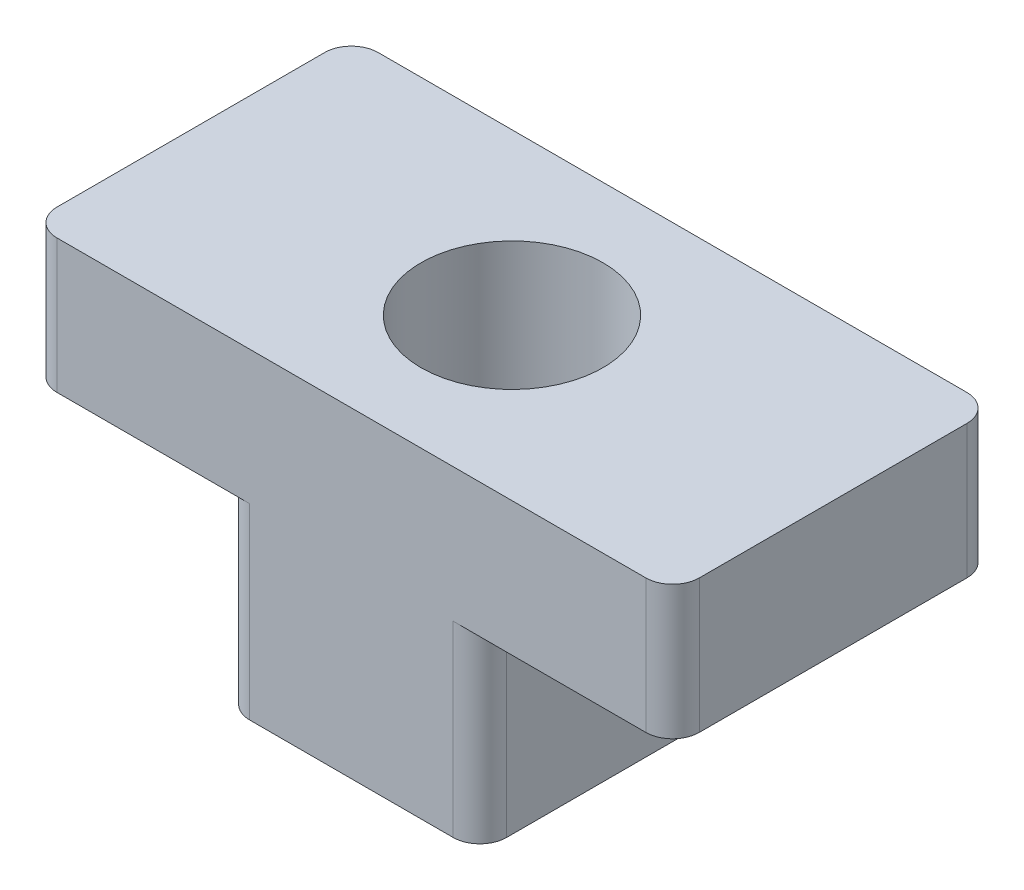
ISO-10303-21;
HEADER;
FILE_DESCRIPTION(('STEP AP214'),'2;1');
FILE_NAME('part.step','',(''),(''),'','','');
FILE_SCHEMA(('AUTOMOTIVE_DESIGN { 1 0 10303 214 1 1 1 1 }'));
ENDSEC;
DATA;
#1=APPLICATION_CONTEXT('core data for automotive mechanical design processes');
#2=APPLICATION_PROTOCOL_DEFINITION('international standard','automotive_design',2000,#1);
#3=PRODUCT_CONTEXT('',#1,'mechanical');
#4=PRODUCT('Part','Part','',(#3));
#5=PRODUCT_RELATED_PRODUCT_CATEGORY('part','',(#4));
#6=PRODUCT_DEFINITION_FORMATION('','',#4);
#7=PRODUCT_DEFINITION_CONTEXT('part definition',#1,'design');
#8=PRODUCT_DEFINITION('design','',#6,#7);
#9=PRODUCT_DEFINITION_SHAPE('','',#8);
#10=(LENGTH_UNIT() NAMED_UNIT(*) SI_UNIT(.MILLI.,.METRE.));
#11=(NAMED_UNIT(*) PLANE_ANGLE_UNIT() SI_UNIT($,.RADIAN.));
#12=(NAMED_UNIT(*) SI_UNIT($,.STERADIAN.) SOLID_ANGLE_UNIT());
#13=UNCERTAINTY_MEASURE_WITH_UNIT(LENGTH_MEASURE(1.E-05),#10,'distance_accuracy_value','');
#14=(GEOMETRIC_REPRESENTATION_CONTEXT(3) GLOBAL_UNCERTAINTY_ASSIGNED_CONTEXT((#13)) GLOBAL_UNIT_ASSIGNED_CONTEXT((#10,
#11,#12)) REPRESENTATION_CONTEXT('',''));
#15=CARTESIAN_POINT('',(0.,0.,0.));
#16=DIRECTION('',(0.,0.,1.));
#17=DIRECTION('',(1.,0.,0.));
#18=AXIS2_PLACEMENT_3D('',#15,#16,#17);
#19=CARTESIAN_POINT('',(6.,0.,3.));
#20=DIRECTION('',(-1.,0.,0.));
#21=DIRECTION('',(0.,0.,1.));
#22=AXIS2_PLACEMENT_3D('',#19,#20,#21);
#23=PLANE('',#22);
#24=DIRECTION('',(0.,0.,-1.));
#25=VECTOR('',#24,1.);
#26=CARTESIAN_POINT('',(6.,0.,3.));
#27=LINE('',#26,#25);
#28=CARTESIAN_POINT('',(6.,0.,2.5));
#29=VERTEX_POINT('',#28);
#30=CARTESIAN_POINT('',(6.,0.,-2.5));
#31=VERTEX_POINT('',#30);
#32=EDGE_CURVE('E187',#29,#31,#27,.T.);
#33=ORIENTED_EDGE('',*,*,#32,.T.);
#34=DIRECTION('',(0.,1.,0.));
#35=VECTOR('',#34,1.);
#36=CARTESIAN_POINT('',(6.,2.5,-2.5));
#37=LINE('',#36,#35);
#38=CARTESIAN_POINT('',(6.,2.5,-2.5));
#39=VERTEX_POINT('',#38);
#40=EDGE_CURVE('E233',#31,#39,#37,.T.);
#41=ORIENTED_EDGE('',*,*,#40,.T.);
#42=DIRECTION('',(0.,0.,-1.));
#43=VECTOR('',#42,1.);
#44=CARTESIAN_POINT('',(6.,2.5,3.));
#45=LINE('',#44,#43);
#46=CARTESIAN_POINT('',(6.,2.5,2.5));
#47=VERTEX_POINT('',#46);
#48=EDGE_CURVE('E193',#47,#39,#45,.T.);
#49=ORIENTED_EDGE('',*,*,#48,.F.);
#50=DIRECTION('',(0.,1.,0.));
#51=VECTOR('',#50,1.);
#52=CARTESIAN_POINT('',(6.,0.,2.5));
#53=LINE('',#52,#51);
#54=EDGE_CURVE('E230',#47,#29,#53,.F.);
#55=ORIENTED_EDGE('',*,*,#54,.T.);
#56=EDGE_LOOP('',(#33,#41,#49,#55));
#57=FACE_BOUND('',#56,.T.);
#58=ADVANCED_FACE('F47',(#57),#23,.F.);
#59=CARTESIAN_POINT('',(-6.,2.5,3.));
#60=DIRECTION('',(0.,-1.,0.));
#61=DIRECTION('',(0.,0.,-1.));
#62=AXIS2_PLACEMENT_3D('',#59,#60,#61);
#63=PLANE('',#62);
#64=CARTESIAN_POINT('',(0.,2.5,0.));
#65=DIRECTION('',(0.,1.,0.));
#66=DIRECTION('',(0.,0.,1.));
#67=AXIS2_PLACEMENT_3D('',#64,#65,#66);
#68=CIRCLE('',#67,1.7);
#69=CARTESIAN_POINT('',(0.,2.5,1.7));
#70=VERTEX_POINT('',#69);
#71=EDGE_CURVE('E381',#70,#70,#68,.T.);
#72=ORIENTED_EDGE('',*,*,#71,.F.);
#73=EDGE_LOOP('',(#72));
#74=FACE_BOUND('',#73,.T.);
#75=ORIENTED_EDGE('',*,*,#48,.T.);
#76=CARTESIAN_POINT('',(5.5,2.5,-2.5));
#77=DIRECTION('',(0.,-1.,0.));
#78=DIRECTION('',(0.,0.,-1.));
#79=AXIS2_PLACEMENT_3D('',#76,#77,#78);
#80=CIRCLE('',#79,0.5);
#81=CARTESIAN_POINT('',(5.5,2.5,-3.));
#82=VERTEX_POINT('',#81);
#83=EDGE_CURVE('E246',#39,#82,#80,.F.);
#84=ORIENTED_EDGE('',*,*,#83,.T.);
#85=DIRECTION('',(-1.,0.,0.));
#86=VECTOR('',#85,1.);
#87=CARTESIAN_POINT('',(-6.,2.5,-3.));
#88=LINE('',#87,#86);
#89=CARTESIAN_POINT('',(-5.5,2.5,-3.));
#90=VERTEX_POINT('',#89);
#91=EDGE_CURVE('E320',#82,#90,#88,.T.);
#92=ORIENTED_EDGE('',*,*,#91,.T.);
#93=CARTESIAN_POINT('',(-5.5,2.5,-2.5));
#94=DIRECTION('',(0.,-1.,0.));
#95=DIRECTION('',(0.,0.,-1.));
#96=AXIS2_PLACEMENT_3D('',#93,#94,#95);
#97=CIRCLE('',#96,0.5);
#98=CARTESIAN_POINT('',(-6.,2.5,-2.5));
#99=VERTEX_POINT('',#98);
#100=EDGE_CURVE('E237',#90,#99,#97,.F.);
#101=ORIENTED_EDGE('',*,*,#100,.T.);
#102=DIRECTION('',(0.,0.,-1.));
#103=VECTOR('',#102,1.);
#104=CARTESIAN_POINT('',(-6.,2.5,3.));
#105=LINE('',#104,#103);
#106=CARTESIAN_POINT('',(-6.,2.5,2.5));
#107=VERTEX_POINT('',#106);
#108=EDGE_CURVE('E203',#107,#99,#105,.T.);
#109=ORIENTED_EDGE('',*,*,#108,.F.);
#110=CARTESIAN_POINT('',(-5.5,2.5,2.5));
#111=DIRECTION('',(0.,-1.,0.));
#112=DIRECTION('',(0.,0.,-1.));
#113=AXIS2_PLACEMENT_3D('',#110,#111,#112);
#114=CIRCLE('',#113,0.5);
#115=CARTESIAN_POINT('',(-5.5,2.5,3.));
#116=VERTEX_POINT('',#115);
#117=EDGE_CURVE('E240',#107,#116,#114,.F.);
#118=ORIENTED_EDGE('',*,*,#117,.T.);
#119=DIRECTION('',(-1.,0.,0.));
#120=VECTOR('',#119,1.);
#121=CARTESIAN_POINT('',(-6.,2.5,3.));
#122=LINE('',#121,#120);
#123=CARTESIAN_POINT('',(5.5,2.5,3.));
#124=VERTEX_POINT('',#123);
#125=EDGE_CURVE('E316',#124,#116,#122,.T.);
#126=ORIENTED_EDGE('',*,*,#125,.F.);
#127=CARTESIAN_POINT('',(5.5,2.5,2.5));
#128=DIRECTION('',(0.,-1.,0.));
#129=DIRECTION('',(0.,0.,-1.));
#130=AXIS2_PLACEMENT_3D('',#127,#128,#129);
#131=CIRCLE('',#130,0.5);
#132=EDGE_CURVE('E243',#124,#47,#131,.F.);
#133=ORIENTED_EDGE('',*,*,#132,.T.);
#134=EDGE_LOOP('',(#75,#84,#92,#101,#109,#118,#126,#133));
#135=FACE_BOUND('',#134,.T.);
#136=ADVANCED_FACE('F356',(#74,#135),#63,.F.);
#137=CARTESIAN_POINT('',(-6.,0.,3.));
#138=DIRECTION('',(1.,0.,0.));
#139=DIRECTION('',(0.,0.,-1.));
#140=AXIS2_PLACEMENT_3D('',#137,#138,#139);
#141=PLANE('',#140);
#142=DIRECTION('',(0.,0.,-1.));
#143=VECTOR('',#142,1.);
#144=CARTESIAN_POINT('',(-6.,0.,3.));
#145=LINE('',#144,#143);
#146=CARTESIAN_POINT('',(-6.,0.,2.5));
#147=VERTEX_POINT('',#146);
#148=CARTESIAN_POINT('',(-6.,0.,-2.5));
#149=VERTEX_POINT('',#148);
#150=EDGE_CURVE('E344',#147,#149,#145,.T.);
#151=ORIENTED_EDGE('',*,*,#150,.F.);
#152=DIRECTION('',(0.,-1.,0.));
#153=VECTOR('',#152,1.);
#154=CARTESIAN_POINT('',(-6.,0.,2.5));
#155=LINE('',#154,#153);
#156=EDGE_CURVE('E283',#147,#107,#155,.F.);
#157=ORIENTED_EDGE('',*,*,#156,.T.);
#158=ORIENTED_EDGE('',*,*,#108,.T.);
#159=DIRECTION('',(0.,-1.,0.));
#160=VECTOR('',#159,1.);
#161=CARTESIAN_POINT('',(-6.,0.,-2.5));
#162=LINE('',#161,#160);
#163=EDGE_CURVE('E281',#99,#149,#162,.T.);
#164=ORIENTED_EDGE('',*,*,#163,.T.);
#165=EDGE_LOOP('',(#151,#157,#158,#164));
#166=FACE_BOUND('',#165,.T.);
#167=ADVANCED_FACE('F350',(#166),#141,.F.);
#168=CARTESIAN_POINT('',(-6.,0.,3.));
#169=DIRECTION('',(0.,1.,0.));
#170=DIRECTION('',(-1.,0.,0.));
#171=AXIS2_PLACEMENT_3D('',#168,#169,#170);
#172=PLANE('',#171);
#173=DIRECTION('',(1.,0.,0.));
#174=VECTOR('',#173,1.);
#175=CARTESIAN_POINT('',(-6.,0.,3.));
#176=LINE('',#175,#174);
#177=CARTESIAN_POINT('',(-5.5,0.,3.));
#178=VERTEX_POINT('',#177);
#179=CARTESIAN_POINT('',(-1.9,0.,3.));
#180=VERTEX_POINT('',#179);
#181=EDGE_CURVE('E295',#178,#180,#176,.T.);
#182=ORIENTED_EDGE('',*,*,#181,.F.);
#183=CARTESIAN_POINT('',(-5.5,0.,2.5));
#184=DIRECTION('',(0.,1.,0.));
#185=DIRECTION('',(-1.,0.,0.));
#186=AXIS2_PLACEMENT_3D('',#183,#184,#185);
#187=CIRCLE('',#186,0.5);
#188=EDGE_CURVE('E71',#178,#147,#187,.F.);
#189=ORIENTED_EDGE('',*,*,#188,.T.);
#190=ORIENTED_EDGE('',*,*,#150,.T.);
#191=CARTESIAN_POINT('',(-5.5,0.,-2.5));
#192=DIRECTION('',(0.,1.,0.));
#193=DIRECTION('',(-1.,0.,0.));
#194=AXIS2_PLACEMENT_3D('',#191,#192,#193);
#195=CIRCLE('',#194,0.5);
#196=CARTESIAN_POINT('',(-5.5,0.,-3.));
#197=VERTEX_POINT('',#196);
#198=EDGE_CURVE('E63',#149,#197,#195,.F.);
#199=ORIENTED_EDGE('',*,*,#198,.T.);
#200=DIRECTION('',(1.,0.,0.));
#201=VECTOR('',#200,1.);
#202=CARTESIAN_POINT('',(-6.,0.,-3.));
#203=LINE('',#202,#201);
#204=CARTESIAN_POINT('',(-1.9,0.,-3.));
#205=VERTEX_POINT('',#204);
#206=EDGE_CURVE('E324',#197,#205,#203,.T.);
#207=ORIENTED_EDGE('',*,*,#206,.T.);
#208=CARTESIAN_POINT('',(-1.9,0.,-2.5));
#209=DIRECTION('',(0.,1.,0.));
#210=DIRECTION('',(-1.,0.,0.));
#211=AXIS2_PLACEMENT_3D('',#208,#209,#210);
#212=CIRCLE('',#211,0.5);
#213=CARTESIAN_POINT('',(-2.4,0.,-2.5));
#214=VERTEX_POINT('',#213);
#215=EDGE_CURVE('E11',#205,#214,#212,.T.);
#216=ORIENTED_EDGE('',*,*,#215,.T.);
#217=DIRECTION('',(0.,0.,-1.));
#218=VECTOR('',#217,1.);
#219=CARTESIAN_POINT('',(-2.4,0.,3.));
#220=LINE('',#219,#218);
#221=CARTESIAN_POINT('',(-2.4,0.,2.5));
#222=VERTEX_POINT('',#221);
#223=EDGE_CURVE('E297',#222,#214,#220,.T.);
#224=ORIENTED_EDGE('',*,*,#223,.F.);
#225=CARTESIAN_POINT('',(-1.9,0.,2.5));
#226=DIRECTION('',(0.,1.,0.));
#227=DIRECTION('',(-1.,0.,0.));
#228=AXIS2_PLACEMENT_3D('',#225,#226,#227);
#229=CIRCLE('',#228,0.5);
#230=EDGE_CURVE('E56',#222,#180,#229,.T.);
#231=ORIENTED_EDGE('',*,*,#230,.T.);
#232=EDGE_LOOP('',(#182,#189,#190,#199,#207,#216,#224,#231));
#233=FACE_BOUND('',#232,.T.);
#234=ADVANCED_FACE('F294',(#233),#172,.F.);
#235=CARTESIAN_POINT('',(-2.4,0.,3.));
#236=DIRECTION('',(1.,0.,0.));
#237=DIRECTION('',(0.,0.,-1.));
#238=AXIS2_PLACEMENT_3D('',#235,#236,#237);
#239=PLANE('',#238);
#240=DIRECTION('',(0.,0.,-1.));
#241=VECTOR('',#240,1.);
#242=CARTESIAN_POINT('',(-2.4,-3.5,3.));
#243=LINE('',#242,#241);
#244=CARTESIAN_POINT('',(-2.4,-3.5,2.5));
#245=VERTEX_POINT('',#244);
#246=CARTESIAN_POINT('',(-2.4,-3.5,-2.5));
#247=VERTEX_POINT('',#246);
#248=EDGE_CURVE('E339',#245,#247,#243,.T.);
#249=ORIENTED_EDGE('',*,*,#248,.F.);
#250=DIRECTION('',(0.,-1.,0.));
#251=VECTOR('',#250,1.);
#252=CARTESIAN_POINT('',(-2.4,0.,2.5));
#253=LINE('',#252,#251);
#254=EDGE_CURVE('E274',#245,#222,#253,.F.);
#255=ORIENTED_EDGE('',*,*,#254,.T.);
#256=ORIENTED_EDGE('',*,*,#223,.T.);
#257=DIRECTION('',(0.,-1.,0.));
#258=VECTOR('',#257,1.);
#259=CARTESIAN_POINT('',(-2.4,-3.5,-2.5));
#260=LINE('',#259,#258);
#261=EDGE_CURVE('E270',#214,#247,#260,.T.);
#262=ORIENTED_EDGE('',*,*,#261,.T.);
#263=EDGE_LOOP('',(#249,#255,#256,#262));
#264=FACE_BOUND('',#263,.T.);
#265=ADVANCED_FACE('F432',(#264),#239,.F.);
#266=CARTESIAN_POINT('',(-2.4,-3.5,3.));
#267=DIRECTION('',(0.,1.,0.));
#268=DIRECTION('',(-1.,0.,0.));
#269=AXIS2_PLACEMENT_3D('',#266,#267,#268);
#270=PLANE('',#269);
#271=CARTESIAN_POINT('',(0.,-3.5,0.));
#272=DIRECTION('',(0.,1.,0.));
#273=DIRECTION('',(0.,0.,1.));
#274=AXIS2_PLACEMENT_3D('',#271,#272,#273);
#275=CIRCLE('',#274,1.7);
#276=CARTESIAN_POINT('',(0.,-3.5,1.7));
#277=VERTEX_POINT('',#276);
#278=EDGE_CURVE('E325',#277,#277,#275,.T.);
#279=ORIENTED_EDGE('',*,*,#278,.T.);
#280=EDGE_LOOP('',(#279));
#281=FACE_BOUND('',#280,.T.);
#282=DIRECTION('',(1.,0.,0.));
#283=VECTOR('',#282,1.);
#284=CARTESIAN_POINT('',(-2.4,-3.5,-3.));
#285=LINE('',#284,#283);
#286=CARTESIAN_POINT('',(-1.9,-3.5,-3.));
#287=VERTEX_POINT('',#286);
#288=CARTESIAN_POINT('',(1.9,-3.5,-3.));
#289=VERTEX_POINT('',#288);
#290=EDGE_CURVE('E328',#287,#289,#285,.T.);
#291=ORIENTED_EDGE('',*,*,#290,.T.);
#292=CARTESIAN_POINT('',(1.9,-3.5,-2.5));
#293=DIRECTION('',(0.,1.,0.));
#294=DIRECTION('',(-1.,0.,0.));
#295=AXIS2_PLACEMENT_3D('',#292,#293,#294);
#296=CIRCLE('',#295,0.5);
#297=CARTESIAN_POINT('',(2.4,-3.5,-2.5));
#298=VERTEX_POINT('',#297);
#299=EDGE_CURVE('E227',#289,#298,#296,.F.);
#300=ORIENTED_EDGE('',*,*,#299,.T.);
#301=DIRECTION('',(0.,0.,-1.));
#302=VECTOR('',#301,1.);
#303=CARTESIAN_POINT('',(2.4,-3.5,3.));
#304=LINE('',#303,#302);
#305=CARTESIAN_POINT('',(2.4,-3.5,2.5));
#306=VERTEX_POINT('',#305);
#307=EDGE_CURVE('E186',#306,#298,#304,.T.);
#308=ORIENTED_EDGE('',*,*,#307,.F.);
#309=CARTESIAN_POINT('',(1.9,-3.5,2.5));
#310=DIRECTION('',(0.,1.,0.));
#311=DIRECTION('',(-1.,0.,0.));
#312=AXIS2_PLACEMENT_3D('',#309,#310,#311);
#313=CIRCLE('',#312,0.5);
#314=CARTESIAN_POINT('',(1.9,-3.5,3.));
#315=VERTEX_POINT('',#314);
#316=EDGE_CURVE('E191',#306,#315,#313,.F.);
#317=ORIENTED_EDGE('',*,*,#316,.T.);
#318=DIRECTION('',(1.,0.,0.));
#319=VECTOR('',#318,1.);
#320=CARTESIAN_POINT('',(-2.4,-3.5,3.));
#321=LINE('',#320,#319);
#322=CARTESIAN_POINT('',(-1.9,-3.5,3.));
#323=VERTEX_POINT('',#322);
#324=EDGE_CURVE('E305',#323,#315,#321,.T.);
#325=ORIENTED_EDGE('',*,*,#324,.F.);
#326=CARTESIAN_POINT('',(-1.9,-3.5,2.5));
#327=DIRECTION('',(0.,1.,0.));
#328=DIRECTION('',(-1.,0.,0.));
#329=AXIS2_PLACEMENT_3D('',#326,#327,#328);
#330=CIRCLE('',#329,0.5);
#331=EDGE_CURVE('E222',#323,#245,#330,.F.);
#332=ORIENTED_EDGE('',*,*,#331,.T.);
#333=ORIENTED_EDGE('',*,*,#248,.T.);
#334=CARTESIAN_POINT('',(-1.9,-3.5,-2.5));
#335=DIRECTION('',(0.,1.,0.));
#336=DIRECTION('',(-1.,0.,0.));
#337=AXIS2_PLACEMENT_3D('',#334,#335,#336);
#338=CIRCLE('',#337,0.5);
#339=EDGE_CURVE('E219',#247,#287,#338,.F.);
#340=ORIENTED_EDGE('',*,*,#339,.T.);
#341=EDGE_LOOP('',(#291,#300,#308,#317,#325,#332,#333,#340));
#342=FACE_BOUND('',#341,.T.);
#343=ADVANCED_FACE('F308',(#281,#342),#270,.F.);
#344=CARTESIAN_POINT('',(2.4,0.,3.));
#345=DIRECTION('',(-1.,0.,0.));
#346=DIRECTION('',(0.,-1.,0.));
#347=AXIS2_PLACEMENT_3D('',#344,#345,#346);
#348=PLANE('',#347);
#349=ORIENTED_EDGE('',*,*,#307,.T.);
#350=DIRECTION('',(0.,1.,0.));
#351=VECTOR('',#350,1.);
#352=CARTESIAN_POINT('',(2.4,0.,-2.5));
#353=LINE('',#352,#351);
#354=CARTESIAN_POINT('',(2.4,0.,-2.5));
#355=VERTEX_POINT('',#354);
#356=EDGE_CURVE('E184',#298,#355,#353,.T.);
#357=ORIENTED_EDGE('',*,*,#356,.T.);
#358=DIRECTION('',(0.,0.,-1.));
#359=VECTOR('',#358,1.);
#360=CARTESIAN_POINT('',(2.4,0.,3.));
#361=LINE('',#360,#359);
#362=CARTESIAN_POINT('',(2.4,0.,2.5));
#363=VERTEX_POINT('',#362);
#364=EDGE_CURVE('E167',#363,#355,#361,.T.);
#365=ORIENTED_EDGE('',*,*,#364,.F.);
#366=DIRECTION('',(0.,1.,0.));
#367=VECTOR('',#366,1.);
#368=CARTESIAN_POINT('',(2.4,0.,2.5));
#369=LINE('',#368,#367);
#370=EDGE_CURVE('E181',#363,#306,#369,.F.);
#371=ORIENTED_EDGE('',*,*,#370,.T.);
#372=EDGE_LOOP('',(#349,#357,#365,#371));
#373=FACE_BOUND('',#372,.T.);
#374=ADVANCED_FACE('F180',(#373),#348,.F.);
#375=CARTESIAN_POINT('',(6.,0.,3.));
#376=DIRECTION('',(0.,1.,0.));
#377=DIRECTION('',(-1.,0.,0.));
#378=AXIS2_PLACEMENT_3D('',#375,#376,#377);
#379=PLANE('',#378);
#380=DIRECTION('',(1.,0.,0.));
#381=VECTOR('',#380,1.);
#382=CARTESIAN_POINT('',(6.,0.,-3.));
#383=LINE('',#382,#381);
#384=CARTESIAN_POINT('',(1.9,0.,-3.));
#385=VERTEX_POINT('',#384);
#386=CARTESIAN_POINT('',(5.5,0.,-3.));
#387=VERTEX_POINT('',#386);
#388=EDGE_CURVE('E331',#385,#387,#383,.T.);
#389=ORIENTED_EDGE('',*,*,#388,.T.);
#390=CARTESIAN_POINT('',(5.5,0.,-2.5));
#391=DIRECTION('',(0.,1.,0.));
#392=DIRECTION('',(-1.,0.,0.));
#393=AXIS2_PLACEMENT_3D('',#390,#391,#392);
#394=CIRCLE('',#393,0.5);
#395=EDGE_CURVE('E252',#387,#31,#394,.F.);
#396=ORIENTED_EDGE('',*,*,#395,.T.);
#397=ORIENTED_EDGE('',*,*,#32,.F.);
#398=CARTESIAN_POINT('',(5.5,0.,2.5));
#399=DIRECTION('',(0.,1.,0.));
#400=DIRECTION('',(-1.,0.,0.));
#401=AXIS2_PLACEMENT_3D('',#398,#399,#400);
#402=CIRCLE('',#401,0.5);
#403=CARTESIAN_POINT('',(5.5,0.,3.));
#404=VERTEX_POINT('',#403);
#405=EDGE_CURVE('E249',#29,#404,#402,.F.);
#406=ORIENTED_EDGE('',*,*,#405,.T.);
#407=DIRECTION('',(1.,0.,0.));
#408=VECTOR('',#407,1.);
#409=CARTESIAN_POINT('',(6.,0.,3.));
#410=LINE('',#409,#408);
#411=CARTESIAN_POINT('',(1.9,0.,3.));
#412=VERTEX_POINT('',#411);
#413=EDGE_CURVE('E169',#412,#404,#410,.T.);
#414=ORIENTED_EDGE('',*,*,#413,.F.);
#415=CARTESIAN_POINT('',(1.9,0.,2.5));
#416=DIRECTION('',(0.,1.,0.));
#417=DIRECTION('',(-1.,0.,0.));
#418=AXIS2_PLACEMENT_3D('',#415,#416,#417);
#419=CIRCLE('',#418,0.5);
#420=EDGE_CURVE('E162',#412,#363,#419,.T.);
#421=ORIENTED_EDGE('',*,*,#420,.T.);
#422=ORIENTED_EDGE('',*,*,#364,.T.);
#423=CARTESIAN_POINT('',(1.9,0.,-2.5));
#424=DIRECTION('',(0.,1.,0.));
#425=DIRECTION('',(-1.,0.,0.));
#426=AXIS2_PLACEMENT_3D('',#423,#424,#425);
#427=CIRCLE('',#426,0.5);
#428=EDGE_CURVE('E175',#355,#385,#427,.T.);
#429=ORIENTED_EDGE('',*,*,#428,.T.);
#430=EDGE_LOOP('',(#389,#396,#397,#406,#414,#421,#422,#429));
#431=FACE_BOUND('',#430,.T.);
#432=ADVANCED_FACE('F165',(#431),#379,.F.);
#433=CARTESIAN_POINT('',(0.,0.,3.));
#434=DIRECTION('',(0.,0.,-1.));
#435=DIRECTION('',(-1.,0.,0.));
#436=AXIS2_PLACEMENT_3D('',#433,#434,#435);
#437=PLANE('',#436);
#438=ORIENTED_EDGE('',*,*,#413,.T.);
#439=DIRECTION('',(0.,1.,0.));
#440=VECTOR('',#439,1.);
#441=CARTESIAN_POINT('',(5.5,0.,3.));
#442=LINE('',#441,#440);
#443=EDGE_CURVE('E266',#404,#124,#442,.T.);
#444=ORIENTED_EDGE('',*,*,#443,.T.);
#445=ORIENTED_EDGE('',*,*,#125,.T.);
#446=DIRECTION('',(0.,-1.,0.));
#447=VECTOR('',#446,1.);
#448=CARTESIAN_POINT('',(-5.5,0.,3.));
#449=LINE('',#448,#447);
#450=EDGE_CURVE('E255',#116,#178,#449,.T.);
#451=ORIENTED_EDGE('',*,*,#450,.T.);
#452=ORIENTED_EDGE('',*,*,#181,.T.);
#453=DIRECTION('',(0.,-1.,0.));
#454=VECTOR('',#453,1.);
#455=CARTESIAN_POINT('',(-1.9,0.,3.));
#456=LINE('',#455,#454);
#457=EDGE_CURVE('E259',#180,#323,#456,.T.);
#458=ORIENTED_EDGE('',*,*,#457,.T.);
#459=ORIENTED_EDGE('',*,*,#324,.T.);
#460=DIRECTION('',(0.,1.,0.));
#461=VECTOR('',#460,1.);
#462=CARTESIAN_POINT('',(1.9,0.,3.));
#463=LINE('',#462,#461);
#464=EDGE_CURVE('E263',#315,#412,#463,.T.);
#465=ORIENTED_EDGE('',*,*,#464,.T.);
#466=EDGE_LOOP('',(#438,#444,#445,#451,#452,#458,#459,#465));
#467=FACE_BOUND('',#466,.T.);
#468=ADVANCED_FACE('F304',(#467),#437,.F.);
#469=CARTESIAN_POINT('',(0.,0.,-3.));
#470=DIRECTION('',(0.,0.,-1.));
#471=DIRECTION('',(-1.,0.,0.));
#472=AXIS2_PLACEMENT_3D('',#469,#470,#471);
#473=PLANE('',#472);
#474=ORIENTED_EDGE('',*,*,#388,.F.);
#475=DIRECTION('',(0.,1.,0.));
#476=VECTOR('',#475,1.);
#477=CARTESIAN_POINT('',(1.9,-3.5,-3.));
#478=LINE('',#477,#476);
#479=EDGE_CURVE('E216',#385,#289,#478,.F.);
#480=ORIENTED_EDGE('',*,*,#479,.T.);
#481=ORIENTED_EDGE('',*,*,#290,.F.);
#482=DIRECTION('',(0.,-1.,0.));
#483=VECTOR('',#482,1.);
#484=CARTESIAN_POINT('',(-1.9,0.,-3.));
#485=LINE('',#484,#483);
#486=EDGE_CURVE('E199',#287,#205,#485,.F.);
#487=ORIENTED_EDGE('',*,*,#486,.T.);
#488=ORIENTED_EDGE('',*,*,#206,.F.);
#489=DIRECTION('',(0.,-1.,0.));
#490=VECTOR('',#489,1.);
#491=CARTESIAN_POINT('',(-5.5,2.5,-3.));
#492=LINE('',#491,#490);
#493=EDGE_CURVE('E210',#197,#90,#492,.F.);
#494=ORIENTED_EDGE('',*,*,#493,.T.);
#495=ORIENTED_EDGE('',*,*,#91,.F.);
#496=DIRECTION('',(0.,1.,0.));
#497=VECTOR('',#496,1.);
#498=CARTESIAN_POINT('',(5.5,0.,-3.));
#499=LINE('',#498,#497);
#500=EDGE_CURVE('E213',#82,#387,#499,.F.);
#501=ORIENTED_EDGE('',*,*,#500,.T.);
#502=EDGE_LOOP('',(#474,#480,#481,#487,#488,#494,#495,#501));
#503=FACE_BOUND('',#502,.T.);
#504=ADVANCED_FACE('F360',(#503),#473,.T.);
#505=CARTESIAN_POINT('',(0.,-3.5,0.));
#506=DIRECTION('',(0.,1.,0.));
#507=DIRECTION('',(0.,0.,1.));
#508=AXIS2_PLACEMENT_3D('',#505,#506,#507);
#509=CYLINDRICAL_SURFACE('',#508,1.7);
#510=ORIENTED_EDGE('',*,*,#278,.F.);
#511=EDGE_LOOP('',(#510));
#512=FACE_BOUND('',#511,.T.);
#513=ORIENTED_EDGE('',*,*,#71,.T.);
#514=EDGE_LOOP('',(#513));
#515=FACE_BOUND('',#514,.T.);
#516=ADVANCED_FACE('F390',(#512,#515),#509,.F.);
#517=CARTESIAN_POINT('',(1.9,0.,-2.5));
#518=DIRECTION('',(0.,-1.,0.));
#519=DIRECTION('',(1.,0.,0.));
#520=AXIS2_PLACEMENT_3D('',#517,#518,#519);
#521=CYLINDRICAL_SURFACE('',#520,0.5);
#522=ORIENTED_EDGE('',*,*,#299,.F.);
#523=ORIENTED_EDGE('',*,*,#479,.F.);
#524=ORIENTED_EDGE('',*,*,#428,.F.);
#525=ORIENTED_EDGE('',*,*,#356,.F.);
#526=EDGE_LOOP('',(#522,#523,#524,#525));
#527=FACE_BOUND('',#526,.T.);
#528=ADVANCED_FACE('F393',(#527),#521,.T.);
#529=CARTESIAN_POINT('',(5.5,0.,-2.5));
#530=DIRECTION('',(0.,-1.,0.));
#531=DIRECTION('',(0.,0.,-1.));
#532=AXIS2_PLACEMENT_3D('',#529,#530,#531);
#533=CYLINDRICAL_SURFACE('',#532,0.5);
#534=ORIENTED_EDGE('',*,*,#395,.F.);
#535=ORIENTED_EDGE('',*,*,#500,.F.);
#536=ORIENTED_EDGE('',*,*,#83,.F.);
#537=ORIENTED_EDGE('',*,*,#40,.F.);
#538=EDGE_LOOP('',(#534,#535,#536,#537));
#539=FACE_BOUND('',#538,.T.);
#540=ADVANCED_FACE('F364',(#539),#533,.T.);
#541=CARTESIAN_POINT('',(5.5,0.,2.5));
#542=DIRECTION('',(0.,1.,0.));
#543=DIRECTION('',(0.,0.,1.));
#544=AXIS2_PLACEMENT_3D('',#541,#542,#543);
#545=CYLINDRICAL_SURFACE('',#544,0.5);
#546=ORIENTED_EDGE('',*,*,#405,.F.);
#547=ORIENTED_EDGE('',*,*,#54,.F.);
#548=ORIENTED_EDGE('',*,*,#132,.F.);
#549=ORIENTED_EDGE('',*,*,#443,.F.);
#550=EDGE_LOOP('',(#546,#547,#548,#549));
#551=FACE_BOUND('',#550,.T.);
#552=ADVANCED_FACE('F372',(#551),#545,.T.);
#553=CARTESIAN_POINT('',(1.9,0.,2.5));
#554=DIRECTION('',(0.,1.,0.));
#555=DIRECTION('',(-1.,0.,0.));
#556=AXIS2_PLACEMENT_3D('',#553,#554,#555);
#557=CYLINDRICAL_SURFACE('',#556,0.5);
#558=ORIENTED_EDGE('',*,*,#316,.F.);
#559=ORIENTED_EDGE('',*,*,#370,.F.);
#560=ORIENTED_EDGE('',*,*,#420,.F.);
#561=ORIENTED_EDGE('',*,*,#464,.F.);
#562=EDGE_LOOP('',(#558,#559,#560,#561));
#563=FACE_BOUND('',#562,.T.);
#564=ADVANCED_FACE('F190',(#563),#557,.T.);
#565=CARTESIAN_POINT('',(-1.9,0.,2.5));
#566=DIRECTION('',(0.,-1.,0.));
#567=DIRECTION('',(0.,0.,-1.));
#568=AXIS2_PLACEMENT_3D('',#565,#566,#567);
#569=CYLINDRICAL_SURFACE('',#568,0.5);
#570=ORIENTED_EDGE('',*,*,#230,.F.);
#571=ORIENTED_EDGE('',*,*,#254,.F.);
#572=ORIENTED_EDGE('',*,*,#331,.F.);
#573=ORIENTED_EDGE('',*,*,#457,.F.);
#574=EDGE_LOOP('',(#570,#571,#572,#573));
#575=FACE_BOUND('',#574,.T.);
#576=ADVANCED_FACE('F300',(#575),#569,.T.);
#577=CARTESIAN_POINT('',(-5.5,0.,2.5));
#578=DIRECTION('',(0.,-1.,0.));
#579=DIRECTION('',(0.,0.,-1.));
#580=AXIS2_PLACEMENT_3D('',#577,#578,#579);
#581=CYLINDRICAL_SURFACE('',#580,0.5);
#582=ORIENTED_EDGE('',*,*,#117,.F.);
#583=ORIENTED_EDGE('',*,*,#156,.F.);
#584=ORIENTED_EDGE('',*,*,#188,.F.);
#585=ORIENTED_EDGE('',*,*,#450,.F.);
#586=EDGE_LOOP('',(#582,#583,#584,#585));
#587=FACE_BOUND('',#586,.T.);
#588=ADVANCED_FACE('F418',(#587),#581,.T.);
#589=CARTESIAN_POINT('',(-5.5,0.,-2.5));
#590=DIRECTION('',(0.,1.,0.));
#591=DIRECTION('',(0.,0.,1.));
#592=AXIS2_PLACEMENT_3D('',#589,#590,#591);
#593=CYLINDRICAL_SURFACE('',#592,0.5);
#594=ORIENTED_EDGE('',*,*,#100,.F.);
#595=ORIENTED_EDGE('',*,*,#493,.F.);
#596=ORIENTED_EDGE('',*,*,#198,.F.);
#597=ORIENTED_EDGE('',*,*,#163,.F.);
#598=EDGE_LOOP('',(#594,#595,#596,#597));
#599=FACE_BOUND('',#598,.T.);
#600=ADVANCED_FACE('F355',(#599),#593,.T.);
#601=CARTESIAN_POINT('',(-1.9,0.,-2.5));
#602=DIRECTION('',(0.,1.,0.));
#603=DIRECTION('',(0.,0.,1.));
#604=AXIS2_PLACEMENT_3D('',#601,#602,#603);
#605=CYLINDRICAL_SURFACE('',#604,0.5);
#606=ORIENTED_EDGE('',*,*,#215,.F.);
#607=ORIENTED_EDGE('',*,*,#486,.F.);
#608=ORIENTED_EDGE('',*,*,#339,.F.);
#609=ORIENTED_EDGE('',*,*,#261,.F.);
#610=EDGE_LOOP('',(#606,#607,#608,#609));
#611=FACE_BOUND('',#610,.T.);
#612=ADVANCED_FACE('F49',(#611),#605,.T.);
#613=CLOSED_SHELL('',(#58,#136,#167,#234,#265,#343,#374,#432,#468,#504,#516,#528,#540,#552,#564,
#576,#588,#600,#612));
#614=MANIFOLD_SOLID_BREP('B2',#613);
#615=ADVANCED_BREP_SHAPE_REPRESENTATION('',(#18,#614),#14);
#616=SHAPE_DEFINITION_REPRESENTATION(#9,#615);
ENDSEC;
END-ISO-10303-21;
